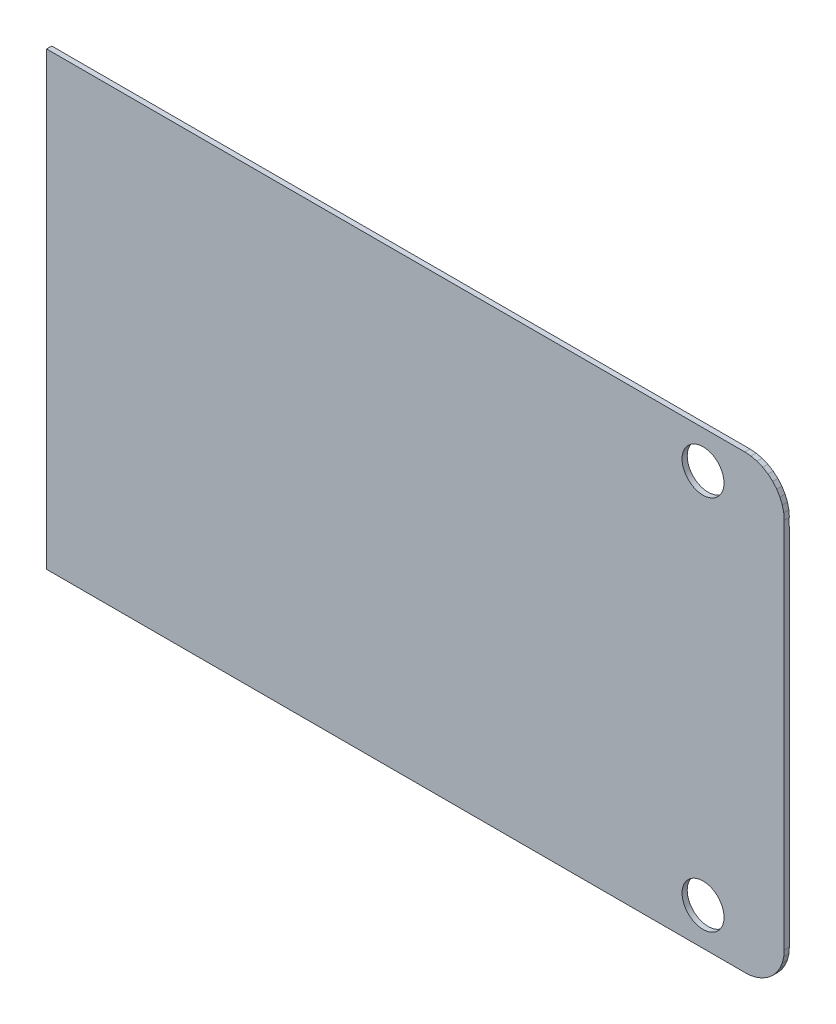
ISO-10303-21;
HEADER;
FILE_DESCRIPTION(('STEP AP214'),'2;1');
FILE_NAME('part.step','',(''),(''),'','','');
FILE_SCHEMA(('AUTOMOTIVE_DESIGN { 1 0 10303 214 1 1 1 1 }'));
ENDSEC;
DATA;
#1=APPLICATION_CONTEXT('core data for automotive mechanical design processes');
#2=APPLICATION_PROTOCOL_DEFINITION('international standard','automotive_design',2000,#1);
#3=PRODUCT_CONTEXT('',#1,'mechanical');
#4=PRODUCT('Part','Part','',(#3));
#5=PRODUCT_RELATED_PRODUCT_CATEGORY('part','',(#4));
#6=PRODUCT_DEFINITION_FORMATION('','',#4);
#7=PRODUCT_DEFINITION_CONTEXT('part definition',#1,'design');
#8=PRODUCT_DEFINITION('design','',#6,#7);
#9=PRODUCT_DEFINITION_SHAPE('','',#8);
#10=(LENGTH_UNIT() NAMED_UNIT(*) SI_UNIT(.MILLI.,.METRE.));
#11=(NAMED_UNIT(*) PLANE_ANGLE_UNIT() SI_UNIT($,.RADIAN.));
#12=(NAMED_UNIT(*) SI_UNIT($,.STERADIAN.) SOLID_ANGLE_UNIT());
#13=UNCERTAINTY_MEASURE_WITH_UNIT(LENGTH_MEASURE(1.E-05),#10,'distance_accuracy_value','');
#14=(GEOMETRIC_REPRESENTATION_CONTEXT(3) GLOBAL_UNCERTAINTY_ASSIGNED_CONTEXT((#13)) GLOBAL_UNIT_ASSIGNED_CONTEXT((#10,
#11,#12)) REPRESENTATION_CONTEXT('',''));
#15=CARTESIAN_POINT('',(0.,0.,0.));
#16=DIRECTION('',(0.,0.,1.));
#17=DIRECTION('',(1.,0.,0.));
#18=AXIS2_PLACEMENT_3D('',#15,#16,#17);
#19=CARTESIAN_POINT('',(42.69702916,-17.2042201,0.39116));
#20=DIRECTION('',(0.,0.,-1.));
#21=DIRECTION('',(-1.,0.,0.));
#22=AXIS2_PLACEMENT_3D('',#19,#20,#21);
#23=PLANE('',#22);
#24=CARTESIAN_POINT('',(39.50940028,14.351,0.39116));
#25=DIRECTION('',(0.,0.,-1.));
#26=DIRECTION('',(-1.,0.,0.));
#27=AXIS2_PLACEMENT_3D('',#24,#25,#26);
#28=CIRCLE('',#27,1.59999934);
#29=CARTESIAN_POINT('',(37.90940094,14.351,0.39116));
#30=VERTEX_POINT('',#29);
#31=EDGE_CURVE('E217',#30,#30,#28,.T.);
#32=ORIENTED_EDGE('',*,*,#31,.T.);
#33=EDGE_LOOP('',(#32));
#34=FACE_BOUND('',#33,.T.);
#35=CARTESIAN_POINT('',(39.50940028,-14.351,0.39116));
#36=DIRECTION('',(0.,0.,-1.));
#37=DIRECTION('',(-1.,0.,0.));
#38=AXIS2_PLACEMENT_3D('',#35,#36,#37);
#39=CIRCLE('',#38,1.59999934);
#40=CARTESIAN_POINT('',(37.90940094,-14.351,0.39116));
#41=VERTEX_POINT('',#40);
#42=EDGE_CURVE('E20',#41,#41,#39,.T.);
#43=ORIENTED_EDGE('',*,*,#42,.T.);
#44=EDGE_LOOP('',(#43));
#45=FACE_BOUND('',#44,.T.);
#46=DIRECTION('',(-0.996917476036965,-0.0784572875651972,0.));
#47=VECTOR('',#46,1.);
#48=CARTESIAN_POINT('',(42.69702916,-17.21349618,0.39116));
#49=LINE('',#48,#47);
#50=CARTESIAN_POINT('',(42.69702916,-17.21349618,0.39116));
#51=VERTEX_POINT('',#50);
#52=CARTESIAN_POINT('',(43.16778514,-17.17644774,0.39116));
#53=VERTEX_POINT('',#52);
#54=EDGE_CURVE('E234',#51,#53,#49,.F.);
#55=ORIENTED_EDGE('',*,*,#54,.T.);
#56=DIRECTION('',(-0.972369331182777,-0.233447818098947,0.));
#57=VECTOR('',#56,1.);
#58=CARTESIAN_POINT('',(43.16778514,-17.17644774,0.39116));
#59=LINE('',#58,#57);
#60=CARTESIAN_POINT('',(43.62694602,-17.06621174,0.39116));
#61=VERTEX_POINT('',#60);
#62=EDGE_CURVE('E238',#53,#61,#59,.F.);
#63=ORIENTED_EDGE('',*,*,#62,.T.);
#64=DIRECTION('',(-0.923879356143185,-0.382683858155076,0.));
#65=VECTOR('',#64,1.);
#66=CARTESIAN_POINT('',(43.62694602,-17.06621174,0.39116));
#67=LINE('',#66,#65);
#68=CARTESIAN_POINT('',(44.06321388,-16.88550344,0.39116));
#69=VERTEX_POINT('',#68);
#70=EDGE_CURVE('E242',#61,#69,#67,.F.);
#71=ORIENTED_EDGE('',*,*,#70,.T.);
#72=DIRECTION('',(-0.852641372425127,-0.522496593318078,0.));
#73=VECTOR('',#72,1.);
#74=CARTESIAN_POINT('',(44.06321388,-16.88550344,0.39116));
#75=LINE('',#74,#73);
#76=CARTESIAN_POINT('',(44.46583944,-16.63877546,0.39116));
#77=VERTEX_POINT('',#76);
#78=EDGE_CURVE('E246',#69,#77,#75,.F.);
#79=ORIENTED_EDGE('',*,*,#78,.T.);
#80=DIRECTION('',(-0.760403230011372,-0.649451251279318,0.));
#81=VECTOR('',#80,1.);
#82=CARTESIAN_POINT('',(44.46583944,-16.63877546,0.39116));
#83=LINE('',#82,#81);
#84=CARTESIAN_POINT('',(44.82490908,-16.3320984,0.39116));
#85=VERTEX_POINT('',#84);
#86=EDGE_CURVE('E250',#77,#85,#83,.F.);
#87=ORIENTED_EDGE('',*,*,#86,.T.);
#88=DIRECTION('',(-0.649451251279318,-0.760403230011372,0.));
#89=VECTOR('',#88,1.);
#90=CARTESIAN_POINT('',(44.82490908,-16.3320984,0.39116));
#91=LINE('',#90,#89);
#92=CARTESIAN_POINT('',(45.13158614,-15.97302876,0.39116));
#93=VERTEX_POINT('',#92);
#94=EDGE_CURVE('E254',#85,#93,#91,.F.);
#95=ORIENTED_EDGE('',*,*,#94,.T.);
#96=DIRECTION('',(-0.522496593318078,-0.852641372425127,0.));
#97=VECTOR('',#96,1.);
#98=CARTESIAN_POINT('',(45.13158614,-15.97302876,0.39116));
#99=LINE('',#98,#97);
#100=CARTESIAN_POINT('',(45.37831412,-15.5704032,0.39116));
#101=VERTEX_POINT('',#100);
#102=EDGE_CURVE('E258',#93,#101,#99,.F.);
#103=ORIENTED_EDGE('',*,*,#102,.T.);
#104=DIRECTION('',(-0.382683858155076,-0.923879356143185,0.));
#105=VECTOR('',#104,1.);
#106=CARTESIAN_POINT('',(45.37831412,-15.5704032,0.39116));
#107=LINE('',#106,#105);
#108=CARTESIAN_POINT('',(45.55902242,-15.13413534,0.39116));
#109=VERTEX_POINT('',#108);
#110=EDGE_CURVE('E262',#101,#109,#107,.F.);
#111=ORIENTED_EDGE('',*,*,#110,.T.);
#112=DIRECTION('',(-0.233447818098947,-0.972369331182777,0.));
#113=VECTOR('',#112,1.);
#114=CARTESIAN_POINT('',(45.55902242,-15.13413534,0.39116));
#115=LINE('',#114,#113);
#116=CARTESIAN_POINT('',(45.66925842,-14.67497446,0.39116));
#117=VERTEX_POINT('',#116);
#118=EDGE_CURVE('E266',#109,#117,#115,.F.);
#119=ORIENTED_EDGE('',*,*,#118,.T.);
#120=DIRECTION('',(-0.0784572875651674,-0.996917476036967,0.));
#121=VECTOR('',#120,1.);
#122=CARTESIAN_POINT('',(45.66925842,-14.67497446,0.39116));
#123=LINE('',#122,#121);
#124=CARTESIAN_POINT('',(45.70630686,-14.2042184800002,0.39116));
#125=VERTEX_POINT('',#124);
#126=EDGE_CURVE('E270',#117,#125,#123,.F.);
#127=ORIENTED_EDGE('',*,*,#126,.T.);
#128=DIRECTION('',(0.000326622323884776,-0.999999946658927,0.));
#129=VECTOR('',#128,1.);
#130=CARTESIAN_POINT('',(45.70630686,-14.20421848,0.39116));
#131=LINE('',#130,#129);
#132=CARTESIAN_POINT('',(45.69703078,14.19579838,0.39116));
#133=VERTEX_POINT('',#132);
#134=EDGE_CURVE('E274',#125,#133,#131,.F.);
#135=ORIENTED_EDGE('',*,*,#134,.T.);
#136=DIRECTION('',(1.,0.,0.));
#137=VECTOR('',#136,1.);
#138=CARTESIAN_POINT('',(45.69703078,14.19579838,0.39116));
#139=LINE('',#138,#137);
#140=CARTESIAN_POINT('',(45.70630686,14.19579838,0.39116));
#141=VERTEX_POINT('',#140);
#142=EDGE_CURVE('E278',#133,#141,#139,.T.);
#143=ORIENTED_EDGE('',*,*,#142,.T.);
#144=DIRECTION('',(0.0784572875651674,-0.996917476036967,0.));
#145=VECTOR('',#144,1.);
#146=CARTESIAN_POINT('',(45.70630686,14.19579838,0.39116));
#147=LINE('',#146,#145);
#148=CARTESIAN_POINT('',(45.66925842,14.66655436,0.39116));
#149=VERTEX_POINT('',#148);
#150=EDGE_CURVE('E282',#141,#149,#147,.F.);
#151=ORIENTED_EDGE('',*,*,#150,.T.);
#152=DIRECTION('',(0.233447818098947,-0.972369331182777,0.));
#153=VECTOR('',#152,1.);
#154=CARTESIAN_POINT('',(45.66925842,14.66655436,0.39116));
#155=LINE('',#154,#153);
#156=CARTESIAN_POINT('',(45.55902242,15.12571524,0.39116));
#157=VERTEX_POINT('',#156);
#158=EDGE_CURVE('E286',#149,#157,#155,.F.);
#159=ORIENTED_EDGE('',*,*,#158,.T.);
#160=DIRECTION('',(0.382683858155076,-0.923879356143185,0.));
#161=VECTOR('',#160,1.);
#162=CARTESIAN_POINT('',(45.55902242,15.12571524,0.39116));
#163=LINE('',#162,#161);
#164=CARTESIAN_POINT('',(45.37831412,15.5619831,0.39116));
#165=VERTEX_POINT('',#164);
#166=EDGE_CURVE('E290',#157,#165,#163,.F.);
#167=ORIENTED_EDGE('',*,*,#166,.T.);
#168=DIRECTION('',(0.522496593318078,-0.852641372425127,0.));
#169=VECTOR('',#168,1.);
#170=CARTESIAN_POINT('',(45.37831412,15.5619831,0.39116));
#171=LINE('',#170,#169);
#172=CARTESIAN_POINT('',(45.13158614,15.96460866,0.39116));
#173=VERTEX_POINT('',#172);
#174=EDGE_CURVE('E294',#165,#173,#171,.F.);
#175=ORIENTED_EDGE('',*,*,#174,.T.);
#176=DIRECTION('',(0.649451251279318,-0.760403230011372,0.));
#177=VECTOR('',#176,1.);
#178=CARTESIAN_POINT('',(45.13158614,15.96460866,0.39116));
#179=LINE('',#178,#177);
#180=CARTESIAN_POINT('',(44.82490908,16.3236783,0.39116));
#181=VERTEX_POINT('',#180);
#182=EDGE_CURVE('E298',#173,#181,#179,.F.);
#183=ORIENTED_EDGE('',*,*,#182,.T.);
#184=DIRECTION('',(0.760403230011372,-0.649451251279318,0.));
#185=VECTOR('',#184,1.);
#186=CARTESIAN_POINT('',(44.82490908,16.3236783,0.39116));
#187=LINE('',#186,#185);
#188=CARTESIAN_POINT('',(44.46583944,16.63035536,0.39116));
#189=VERTEX_POINT('',#188);
#190=EDGE_CURVE('E302',#181,#189,#187,.F.);
#191=ORIENTED_EDGE('',*,*,#190,.T.);
#192=DIRECTION('',(0.852641372425127,-0.522496593318078,0.));
#193=VECTOR('',#192,1.);
#194=CARTESIAN_POINT('',(44.46583944,16.63035536,0.39116));
#195=LINE('',#194,#193);
#196=CARTESIAN_POINT('',(44.06321388,16.87708334,0.39116));
#197=VERTEX_POINT('',#196);
#198=EDGE_CURVE('E306',#189,#197,#195,.F.);
#199=ORIENTED_EDGE('',*,*,#198,.T.);
#200=DIRECTION('',(0.923879356143185,-0.382683858155076,0.));
#201=VECTOR('',#200,1.);
#202=CARTESIAN_POINT('',(44.06321388,16.87708334,0.39116));
#203=LINE('',#202,#201);
#204=CARTESIAN_POINT('',(43.62694602,17.05779164,0.39116));
#205=VERTEX_POINT('',#204);
#206=EDGE_CURVE('E310',#197,#205,#203,.F.);
#207=ORIENTED_EDGE('',*,*,#206,.T.);
#208=DIRECTION('',(0.972369331182777,-0.233447818098947,0.));
#209=VECTOR('',#208,1.);
#210=CARTESIAN_POINT('',(43.62694602,17.05779164,0.39116));
#211=LINE('',#210,#209);
#212=CARTESIAN_POINT('',(43.16778514,17.16802764,0.39116));
#213=VERTEX_POINT('',#212);
#214=EDGE_CURVE('E314',#205,#213,#211,.F.);
#215=ORIENTED_EDGE('',*,*,#214,.T.);
#216=DIRECTION('',(0.996917476036965,-0.0784572875651972,0.));
#217=VECTOR('',#216,1.);
#218=CARTESIAN_POINT('',(43.16778514,17.16802764,0.39116));
#219=LINE('',#218,#217);
#220=CARTESIAN_POINT('',(42.6970291599995,17.20507608,0.39116));
#221=VERTEX_POINT('',#220);
#222=EDGE_CURVE('E318',#213,#221,#219,.F.);
#223=ORIENTED_EDGE('',*,*,#222,.T.);
#224=DIRECTION('',(0.999999984849512,0.000174071752104015,0.));
#225=VECTOR('',#224,1.);
#226=CARTESIAN_POINT('',(42.69702916,17.20507608,0.39116));
#227=LINE('',#226,#225);
#228=CARTESIAN_POINT('',(-10.5918,17.1958,0.39116));
#229=VERTEX_POINT('',#228);
#230=EDGE_CURVE('E188',#221,#229,#227,.F.);
#231=ORIENTED_EDGE('',*,*,#230,.T.);
#232=DIRECTION('',(0.,1.,0.));
#233=VECTOR('',#232,1.);
#234=CARTESIAN_POINT('',(-10.5918,17.1958,0.39116));
#235=LINE('',#234,#233);
#236=CARTESIAN_POINT('',(-10.5918,-17.2042201,0.39116));
#237=VERTEX_POINT('',#236);
#238=EDGE_CURVE('E190',#229,#237,#235,.F.);
#239=ORIENTED_EDGE('',*,*,#238,.T.);
#240=DIRECTION('',(1.,0.,0.));
#241=VECTOR('',#240,1.);
#242=CARTESIAN_POINT('',(-10.5918,-17.2042201,0.39116));
#243=LINE('',#242,#241);
#244=CARTESIAN_POINT('',(42.69702916,-17.2042201,0.39116));
#245=VERTEX_POINT('',#244);
#246=EDGE_CURVE('E192',#237,#245,#243,.T.);
#247=ORIENTED_EDGE('',*,*,#246,.T.);
#248=DIRECTION('',(0.,1.,0.));
#249=VECTOR('',#248,1.);
#250=CARTESIAN_POINT('',(42.69702916,-17.2042201,0.39116));
#251=LINE('',#250,#249);
#252=EDGE_CURVE('E226',#245,#51,#251,.F.);
#253=ORIENTED_EDGE('',*,*,#252,.T.);
#254=EDGE_LOOP('',(#55,#63,#71,#79,#87,#95,#103,#111,#119,#127,#135,#143,#151,#159,#167,#175,
#183,#191,#199,#207,#215,#223,#231,#239,#247,#253));
#255=FACE_BOUND('',#254,.T.);
#256=ADVANCED_FACE('F17',(#34,#45,#255),#23,.F.);
#257=CARTESIAN_POINT('',(-10.5918,-17.2042201,0.));
#258=DIRECTION('',(0.,1.,0.));
#259=DIRECTION('',(0.,0.,1.));
#260=AXIS2_PLACEMENT_3D('',#257,#258,#259);
#261=PLANE('',#260);
#262=DIRECTION('',(0.,0.,-1.));
#263=VECTOR('',#262,1.);
#264=CARTESIAN_POINT('',(42.69702916,-17.2042201,0.));
#265=LINE('',#264,#263);
#266=CARTESIAN_POINT('',(42.69702916,-17.2042201,0.));
#267=VERTEX_POINT('',#266);
#268=EDGE_CURVE('E203',#267,#245,#265,.F.);
#269=ORIENTED_EDGE('',*,*,#268,.T.);
#270=ORIENTED_EDGE('',*,*,#246,.F.);
#271=DIRECTION('',(0.,0.,-1.));
#272=VECTOR('',#271,1.);
#273=CARTESIAN_POINT('',(-10.5918,-17.2042201,0.));
#274=LINE('',#273,#272);
#275=CARTESIAN_POINT('',(-10.5918,-17.2042201,0.));
#276=VERTEX_POINT('',#275);
#277=EDGE_CURVE('E197',#237,#276,#274,.T.);
#278=ORIENTED_EDGE('',*,*,#277,.T.);
#279=DIRECTION('',(-1.,0.,0.));
#280=VECTOR('',#279,1.);
#281=CARTESIAN_POINT('',(42.69702916,-17.2042201,0.));
#282=LINE('',#281,#280);
#283=EDGE_CURVE('E219',#267,#276,#282,.T.);
#284=ORIENTED_EDGE('',*,*,#283,.F.);
#285=EDGE_LOOP('',(#269,#270,#278,#284));
#286=FACE_BOUND('',#285,.T.);
#287=ADVANCED_FACE('F200',(#286),#261,.F.);
#288=CARTESIAN_POINT('',(-10.5918,17.1958,0.));
#289=DIRECTION('',(1.,0.,0.));
#290=DIRECTION('',(0.,0.,-1.));
#291=AXIS2_PLACEMENT_3D('',#288,#289,#290);
#292=PLANE('',#291);
#293=ORIENTED_EDGE('',*,*,#277,.F.);
#294=ORIENTED_EDGE('',*,*,#238,.F.);
#295=DIRECTION('',(0.,0.,1.));
#296=VECTOR('',#295,1.);
#297=CARTESIAN_POINT('',(-10.5918,17.1958,0.));
#298=LINE('',#297,#296);
#299=CARTESIAN_POINT('',(-10.5918,17.1958,0.));
#300=VERTEX_POINT('',#299);
#301=EDGE_CURVE('E211',#229,#300,#298,.F.);
#302=ORIENTED_EDGE('',*,*,#301,.T.);
#303=DIRECTION('',(0.,1.,0.));
#304=VECTOR('',#303,1.);
#305=CARTESIAN_POINT('',(-10.5918,-17.2042201,0.));
#306=LINE('',#305,#304);
#307=EDGE_CURVE('E208',#276,#300,#306,.T.);
#308=ORIENTED_EDGE('',*,*,#307,.F.);
#309=EDGE_LOOP('',(#293,#294,#302,#308));
#310=FACE_BOUND('',#309,.T.);
#311=ADVANCED_FACE('F206',(#310),#292,.F.);
#312=CARTESIAN_POINT('',(42.69702916,17.20507608,0.));
#313=DIRECTION('',(0.000174071752104015,-0.999999984849512,0.));
#314=DIRECTION('',(0.999999984849512,0.000174071752104015,0.));
#315=AXIS2_PLACEMENT_3D('',#312,#313,#314);
#316=PLANE('',#315);
#317=ORIENTED_EDGE('',*,*,#301,.F.);
#318=ORIENTED_EDGE('',*,*,#230,.F.);
#319=DIRECTION('',(0.,0.,1.));
#320=VECTOR('',#319,1.);
#321=CARTESIAN_POINT('',(42.69702916,17.20507608,0.));
#322=LINE('',#321,#320);
#323=CARTESIAN_POINT('',(42.6970291599997,17.20507608,0.));
#324=VERTEX_POINT('',#323);
#325=EDGE_CURVE('E316',#221,#324,#322,.F.);
#326=ORIENTED_EDGE('',*,*,#325,.T.);
#327=DIRECTION('',(0.999999984849512,0.000174071752104376,0.));
#328=VECTOR('',#327,1.);
#329=CARTESIAN_POINT('',(-10.5918,17.1958,0.));
#330=LINE('',#329,#328);
#331=EDGE_CURVE('E322',#300,#324,#330,.T.);
#332=ORIENTED_EDGE('',*,*,#331,.F.);
#333=EDGE_LOOP('',(#317,#318,#326,#332));
#334=FACE_BOUND('',#333,.T.);
#335=ADVANCED_FACE('F323',(#334),#316,.F.);
#336=CARTESIAN_POINT('',(43.16778514,17.16802764,0.));
#337=DIRECTION('',(-0.0784572875651972,-0.996917476036965,0.));
#338=DIRECTION('',(0.996917476036965,-0.0784572875651972,0.));
#339=AXIS2_PLACEMENT_3D('',#336,#337,#338);
#340=PLANE('',#339);
#341=ORIENTED_EDGE('',*,*,#325,.F.);
#342=ORIENTED_EDGE('',*,*,#222,.F.);
#343=DIRECTION('',(0.,0.,1.));
#344=VECTOR('',#343,1.);
#345=CARTESIAN_POINT('',(43.16778514,17.1680276400001,0.));
#346=LINE('',#345,#344);
#347=CARTESIAN_POINT('',(43.16778514,17.16802764,0.));
#348=VERTEX_POINT('',#347);
#349=EDGE_CURVE('E312',#213,#348,#346,.F.);
#350=ORIENTED_EDGE('',*,*,#349,.T.);
#351=DIRECTION('',(0.996917476036962,-0.0784572875652345,0.));
#352=VECTOR('',#351,1.);
#353=CARTESIAN_POINT('',(42.69702916,17.20507608,0.));
#354=LINE('',#353,#352);
#355=EDGE_CURVE('E328',#324,#348,#354,.T.);
#356=ORIENTED_EDGE('',*,*,#355,.F.);
#357=EDGE_LOOP('',(#341,#342,#350,#356));
#358=FACE_BOUND('',#357,.T.);
#359=ADVANCED_FACE('F503',(#358),#340,.F.);
#360=CARTESIAN_POINT('',(43.62694602,17.05779164,0.));
#361=DIRECTION('',(-0.233447818098947,-0.972369331182777,0.));
#362=DIRECTION('',(0.972369331182777,-0.233447818098947,0.));
#363=AXIS2_PLACEMENT_3D('',#360,#361,#362);
#364=PLANE('',#363);
#365=ORIENTED_EDGE('',*,*,#349,.F.);
#366=ORIENTED_EDGE('',*,*,#214,.F.);
#367=DIRECTION('',(0.,0.,1.));
#368=VECTOR('',#367,1.);
#369=CARTESIAN_POINT('',(43.62694602,17.0577916400001,0.));
#370=LINE('',#369,#368);
#371=CARTESIAN_POINT('',(43.62694602,17.05779164,0.));
#372=VERTEX_POINT('',#371);
#373=EDGE_CURVE('E308',#205,#372,#370,.F.);
#374=ORIENTED_EDGE('',*,*,#373,.T.);
#375=DIRECTION('',(0.972369331182841,-0.233447818098681,0.));
#376=VECTOR('',#375,1.);
#377=CARTESIAN_POINT('',(43.16778514,17.16802764,0.));
#378=LINE('',#377,#376);
#379=EDGE_CURVE('E335',#348,#372,#378,.T.);
#380=ORIENTED_EDGE('',*,*,#379,.F.);
#381=EDGE_LOOP('',(#365,#366,#374,#380));
#382=FACE_BOUND('',#381,.T.);
#383=ADVANCED_FACE('F500',(#382),#364,.F.);
#384=CARTESIAN_POINT('',(44.06321388,16.87708334,0.));
#385=DIRECTION('',(-0.382683858155076,-0.923879356143185,0.));
#386=DIRECTION('',(0.923879356143185,-0.382683858155076,0.));
#387=AXIS2_PLACEMENT_3D('',#384,#385,#386);
#388=PLANE('',#387);
#389=ORIENTED_EDGE('',*,*,#373,.F.);
#390=ORIENTED_EDGE('',*,*,#206,.F.);
#391=DIRECTION('',(0.,0.,1.));
#392=VECTOR('',#391,1.);
#393=CARTESIAN_POINT('',(44.0632138799999,16.8770833399999,0.));
#394=LINE('',#393,#392);
#395=CARTESIAN_POINT('',(44.06321388,16.87708334,0.));
#396=VERTEX_POINT('',#395);
#397=EDGE_CURVE('E304',#197,#396,#394,.F.);
#398=ORIENTED_EDGE('',*,*,#397,.T.);
#399=DIRECTION('',(0.92387935614329,-0.382683858154822,0.));
#400=VECTOR('',#399,1.);
#401=CARTESIAN_POINT('',(43.62694602,17.05779164,0.));
#402=LINE('',#401,#400);
#403=EDGE_CURVE('E338',#372,#396,#402,.T.);
#404=ORIENTED_EDGE('',*,*,#403,.F.);
#405=EDGE_LOOP('',(#389,#390,#398,#404));
#406=FACE_BOUND('',#405,.T.);
#407=ADVANCED_FACE('F495',(#406),#388,.F.);
#408=CARTESIAN_POINT('',(44.46583944,16.63035536,0.));
#409=DIRECTION('',(-0.522496593318078,-0.852641372425127,0.));
#410=DIRECTION('',(0.852641372425127,-0.522496593318078,0.));
#411=AXIS2_PLACEMENT_3D('',#408,#409,#410);
#412=PLANE('',#411);
#413=ORIENTED_EDGE('',*,*,#397,.F.);
#414=ORIENTED_EDGE('',*,*,#198,.F.);
#415=DIRECTION('',(0.,0.,1.));
#416=VECTOR('',#415,1.);
#417=CARTESIAN_POINT('',(44.46583944,16.63035536,0.));
#418=LINE('',#417,#416);
#419=CARTESIAN_POINT('',(44.46583944,16.63035536,0.));
#420=VERTEX_POINT('',#419);
#421=EDGE_CURVE('E300',#189,#420,#418,.F.);
#422=ORIENTED_EDGE('',*,*,#421,.T.);
#423=DIRECTION('',(0.852641372425021,-0.522496593318249,0.));
#424=VECTOR('',#423,1.);
#425=CARTESIAN_POINT('',(44.06321388,16.87708334,0.));
#426=LINE('',#425,#424);
#427=EDGE_CURVE('E341',#396,#420,#426,.T.);
#428=ORIENTED_EDGE('',*,*,#427,.F.);
#429=EDGE_LOOP('',(#413,#414,#422,#428));
#430=FACE_BOUND('',#429,.T.);
#431=ADVANCED_FACE('F490',(#430),#412,.F.);
#432=CARTESIAN_POINT('',(44.82490908,16.3236783,0.));
#433=DIRECTION('',(-0.649451251279318,-0.760403230011372,0.));
#434=DIRECTION('',(0.760403230011372,-0.649451251279318,0.));
#435=AXIS2_PLACEMENT_3D('',#432,#433,#434);
#436=PLANE('',#435);
#437=ORIENTED_EDGE('',*,*,#421,.F.);
#438=ORIENTED_EDGE('',*,*,#190,.F.);
#439=DIRECTION('',(0.,0.,1.));
#440=VECTOR('',#439,1.);
#441=CARTESIAN_POINT('',(44.82490908,16.3236783,0.));
#442=LINE('',#441,#440);
#443=CARTESIAN_POINT('',(44.82490908,16.3236783,0.));
#444=VERTEX_POINT('',#443);
#445=EDGE_CURVE('E296',#181,#444,#442,.F.);
#446=ORIENTED_EDGE('',*,*,#445,.T.);
#447=DIRECTION('',(0.760403230011402,-0.649451251279283,0.));
#448=VECTOR('',#447,1.);
#449=CARTESIAN_POINT('',(44.46583944,16.63035536,0.));
#450=LINE('',#449,#448);
#451=EDGE_CURVE('E344',#420,#444,#450,.T.);
#452=ORIENTED_EDGE('',*,*,#451,.F.);
#453=EDGE_LOOP('',(#437,#438,#446,#452));
#454=FACE_BOUND('',#453,.T.);
#455=ADVANCED_FACE('F485',(#454),#436,.F.);
#456=CARTESIAN_POINT('',(45.13158614,15.96460866,0.));
#457=DIRECTION('',(-0.760403230011372,-0.649451251279318,0.));
#458=DIRECTION('',(0.649451251279318,-0.760403230011372,0.));
#459=AXIS2_PLACEMENT_3D('',#456,#457,#458);
#460=PLANE('',#459);
#461=ORIENTED_EDGE('',*,*,#445,.F.);
#462=ORIENTED_EDGE('',*,*,#182,.F.);
#463=DIRECTION('',(0.,0.,1.));
#464=VECTOR('',#463,1.);
#465=CARTESIAN_POINT('',(45.1315861400001,15.96460866,0.));
#466=LINE('',#465,#464);
#467=CARTESIAN_POINT('',(45.13158614,15.96460866,0.));
#468=VERTEX_POINT('',#467);
#469=EDGE_CURVE('E292',#173,#468,#466,.F.);
#470=ORIENTED_EDGE('',*,*,#469,.T.);
#471=DIRECTION('',(0.649451251279293,-0.760403230011394,0.));
#472=VECTOR('',#471,1.);
#473=CARTESIAN_POINT('',(44.82490908,16.3236783,0.));
#474=LINE('',#473,#472);
#475=EDGE_CURVE('E347',#444,#468,#474,.T.);
#476=ORIENTED_EDGE('',*,*,#475,.F.);
#477=EDGE_LOOP('',(#461,#462,#470,#476));
#478=FACE_BOUND('',#477,.T.);
#479=ADVANCED_FACE('F480',(#478),#460,.F.);
#480=CARTESIAN_POINT('',(45.37831412,15.5619831,0.));
#481=DIRECTION('',(-0.852641372425127,-0.522496593318078,0.));
#482=DIRECTION('',(0.522496593318078,-0.852641372425127,0.));
#483=AXIS2_PLACEMENT_3D('',#480,#481,#482);
#484=PLANE('',#483);
#485=ORIENTED_EDGE('',*,*,#469,.F.);
#486=ORIENTED_EDGE('',*,*,#174,.F.);
#487=DIRECTION('',(0.,0.,1.));
#488=VECTOR('',#487,1.);
#489=CARTESIAN_POINT('',(45.3783141199999,15.5619830999999,0.));
#490=LINE('',#489,#488);
#491=CARTESIAN_POINT('',(45.37831412,15.5619831,0.));
#492=VERTEX_POINT('',#491);
#493=EDGE_CURVE('E288',#165,#492,#490,.F.);
#494=ORIENTED_EDGE('',*,*,#493,.T.);
#495=DIRECTION('',(0.522496593318239,-0.852641372425028,0.));
#496=VECTOR('',#495,1.);
#497=CARTESIAN_POINT('',(45.13158614,15.96460866,0.));
#498=LINE('',#497,#496);
#499=EDGE_CURVE('E350',#468,#492,#498,.T.);
#500=ORIENTED_EDGE('',*,*,#499,.F.);
#501=EDGE_LOOP('',(#485,#486,#494,#500));
#502=FACE_BOUND('',#501,.T.);
#503=ADVANCED_FACE('F475',(#502),#484,.F.);
#504=CARTESIAN_POINT('',(45.55902242,15.12571524,0.));
#505=DIRECTION('',(-0.923879356143185,-0.382683858155076,0.));
#506=DIRECTION('',(0.382683858155076,-0.923879356143185,0.));
#507=AXIS2_PLACEMENT_3D('',#504,#505,#506);
#508=PLANE('',#507);
#509=ORIENTED_EDGE('',*,*,#493,.F.);
#510=ORIENTED_EDGE('',*,*,#166,.F.);
#511=DIRECTION('',(0.,0.,1.));
#512=VECTOR('',#511,1.);
#513=CARTESIAN_POINT('',(45.5590224199999,15.12571524,0.));
#514=LINE('',#513,#512);
#515=CARTESIAN_POINT('',(45.55902242,15.12571524,0.));
#516=VERTEX_POINT('',#515);
#517=EDGE_CURVE('E284',#157,#516,#514,.F.);
#518=ORIENTED_EDGE('',*,*,#517,.T.);
#519=DIRECTION('',(0.382683858154822,-0.92387935614329,0.));
#520=VECTOR('',#519,1.);
#521=CARTESIAN_POINT('',(45.37831412,15.5619831,0.));
#522=LINE('',#521,#520);
#523=EDGE_CURVE('E353',#492,#516,#522,.T.);
#524=ORIENTED_EDGE('',*,*,#523,.F.);
#525=EDGE_LOOP('',(#509,#510,#518,#524));
#526=FACE_BOUND('',#525,.T.);
#527=ADVANCED_FACE('F470',(#526),#508,.F.);
#528=CARTESIAN_POINT('',(45.66925842,14.66655436,0.));
#529=DIRECTION('',(-0.972369331182777,-0.233447818098947,0.));
#530=DIRECTION('',(0.233447818098947,-0.972369331182777,0.));
#531=AXIS2_PLACEMENT_3D('',#528,#529,#530);
#532=PLANE('',#531);
#533=ORIENTED_EDGE('',*,*,#517,.F.);
#534=ORIENTED_EDGE('',*,*,#158,.F.);
#535=DIRECTION('',(0.,0.,1.));
#536=VECTOR('',#535,1.);
#537=CARTESIAN_POINT('',(45.66925842,14.66655436,0.));
#538=LINE('',#537,#536);
#539=CARTESIAN_POINT('',(45.66925842,14.66655436,0.));
#540=VERTEX_POINT('',#539);
#541=EDGE_CURVE('E280',#149,#540,#538,.F.);
#542=ORIENTED_EDGE('',*,*,#541,.T.);
#543=DIRECTION('',(0.233447818098681,-0.972369331182841,0.));
#544=VECTOR('',#543,1.);
#545=CARTESIAN_POINT('',(45.55902242,15.12571524,0.));
#546=LINE('',#545,#544);
#547=EDGE_CURVE('E356',#516,#540,#546,.T.);
#548=ORIENTED_EDGE('',*,*,#547,.F.);
#549=EDGE_LOOP('',(#533,#534,#542,#548));
#550=FACE_BOUND('',#549,.T.);
#551=ADVANCED_FACE('F465',(#550),#532,.F.);
#552=CARTESIAN_POINT('',(45.70630686,14.19579838,0.));
#553=DIRECTION('',(-0.996917476036967,-0.0784572875651674,0.));
#554=DIRECTION('',(0.0784572875651674,-0.996917476036967,0.));
#555=AXIS2_PLACEMENT_3D('',#552,#553,#554);
#556=PLANE('',#555);
#557=ORIENTED_EDGE('',*,*,#541,.F.);
#558=ORIENTED_EDGE('',*,*,#150,.F.);
#559=DIRECTION('',(0.,0.,1.));
#560=VECTOR('',#559,1.);
#561=CARTESIAN_POINT('',(45.70630686,14.19579838,0.));
#562=LINE('',#561,#560);
#563=CARTESIAN_POINT('',(45.70630686,14.19579838,0.));
#564=VERTEX_POINT('',#563);
#565=EDGE_CURVE('E276',#141,#564,#562,.F.);
#566=ORIENTED_EDGE('',*,*,#565,.T.);
#567=DIRECTION('',(0.0784572875652187,-0.996917476036963,0.));
#568=VECTOR('',#567,1.);
#569=CARTESIAN_POINT('',(45.66925842,14.66655436,0.));
#570=LINE('',#569,#568);
#571=EDGE_CURVE('E359',#540,#564,#570,.T.);
#572=ORIENTED_EDGE('',*,*,#571,.F.);
#573=EDGE_LOOP('',(#557,#558,#566,#572));
#574=FACE_BOUND('',#573,.T.);
#575=ADVANCED_FACE('F460',(#574),#556,.F.);
#576=CARTESIAN_POINT('',(45.69703078,14.19579838,0.));
#577=DIRECTION('',(0.,1.,0.));
#578=DIRECTION('',(0.,0.,1.));
#579=AXIS2_PLACEMENT_3D('',#576,#577,#578);
#580=PLANE('',#579);
#581=ORIENTED_EDGE('',*,*,#565,.F.);
#582=ORIENTED_EDGE('',*,*,#142,.F.);
#583=DIRECTION('',(0.,0.,1.));
#584=VECTOR('',#583,1.);
#585=CARTESIAN_POINT('',(45.69703078,14.19579838,0.));
#586=LINE('',#585,#584);
#587=CARTESIAN_POINT('',(45.69703078,14.19579838,0.));
#588=VERTEX_POINT('',#587);
#589=EDGE_CURVE('E272',#133,#588,#586,.F.);
#590=ORIENTED_EDGE('',*,*,#589,.T.);
#591=DIRECTION('',(-1.,0.,0.));
#592=VECTOR('',#591,1.);
#593=CARTESIAN_POINT('',(42.69702916,14.19579838,0.));
#594=LINE('',#593,#592);
#595=EDGE_CURVE('E362',#564,#588,#594,.T.);
#596=ORIENTED_EDGE('',*,*,#595,.F.);
#597=EDGE_LOOP('',(#581,#582,#590,#596));
#598=FACE_BOUND('',#597,.T.);
#599=ADVANCED_FACE('F455',(#598),#580,.F.);
#600=CARTESIAN_POINT('',(45.70630686,-14.20421848,0.));
#601=DIRECTION('',(-0.999999946658927,-0.000326622323884776,0.));
#602=DIRECTION('',(0.000326622323884776,-0.999999946658927,0.));
#603=AXIS2_PLACEMENT_3D('',#600,#601,#602);
#604=PLANE('',#603);
#605=ORIENTED_EDGE('',*,*,#589,.F.);
#606=ORIENTED_EDGE('',*,*,#134,.F.);
#607=DIRECTION('',(0.,0.,1.));
#608=VECTOR('',#607,1.);
#609=CARTESIAN_POINT('',(45.70630686,-14.20421848,0.));
#610=LINE('',#609,#608);
#611=CARTESIAN_POINT('',(45.70630686,-14.2042184800001,0.));
#612=VERTEX_POINT('',#611);
#613=EDGE_CURVE('E268',#125,#612,#610,.F.);
#614=ORIENTED_EDGE('',*,*,#613,.T.);
#615=DIRECTION('',(0.000326622323885451,-0.999999946658927,0.));
#616=VECTOR('',#615,1.);
#617=CARTESIAN_POINT('',(45.69703078,14.19579838,0.));
#618=LINE('',#617,#616);
#619=EDGE_CURVE('E365',#588,#612,#618,.T.);
#620=ORIENTED_EDGE('',*,*,#619,.F.);
#621=EDGE_LOOP('',(#605,#606,#614,#620));
#622=FACE_BOUND('',#621,.T.);
#623=ADVANCED_FACE('F450',(#622),#604,.F.);
#624=CARTESIAN_POINT('',(45.66925842,-14.67497446,0.));
#625=DIRECTION('',(-0.996917476036967,0.0784572875651674,0.));
#626=DIRECTION('',(-0.0784572875651674,-0.996917476036967,0.));
#627=AXIS2_PLACEMENT_3D('',#624,#625,#626);
#628=PLANE('',#627);
#629=ORIENTED_EDGE('',*,*,#613,.F.);
#630=ORIENTED_EDGE('',*,*,#126,.F.);
#631=DIRECTION('',(0.,0.,1.));
#632=VECTOR('',#631,1.);
#633=CARTESIAN_POINT('',(45.6692584200001,-14.67497446,0.));
#634=LINE('',#633,#632);
#635=CARTESIAN_POINT('',(45.66925842,-14.67497446,0.));
#636=VERTEX_POINT('',#635);
#637=EDGE_CURVE('E264',#117,#636,#634,.F.);
#638=ORIENTED_EDGE('',*,*,#637,.T.);
#639=DIRECTION('',(-0.078457287565219,-0.996917476036963,0.));
#640=VECTOR('',#639,1.);
#641=CARTESIAN_POINT('',(45.70630686,-14.20421848,0.));
#642=LINE('',#641,#640);
#643=EDGE_CURVE('E368',#612,#636,#642,.T.);
#644=ORIENTED_EDGE('',*,*,#643,.F.);
#645=EDGE_LOOP('',(#629,#630,#638,#644));
#646=FACE_BOUND('',#645,.T.);
#647=ADVANCED_FACE('F445',(#646),#628,.F.);
#648=CARTESIAN_POINT('',(45.55902242,-15.13413534,0.));
#649=DIRECTION('',(-0.972369331182777,0.233447818098947,0.));
#650=DIRECTION('',(-0.233447818098947,-0.972369331182777,0.));
#651=AXIS2_PLACEMENT_3D('',#648,#649,#650);
#652=PLANE('',#651);
#653=ORIENTED_EDGE('',*,*,#637,.F.);
#654=ORIENTED_EDGE('',*,*,#118,.F.);
#655=DIRECTION('',(0.,0.,1.));
#656=VECTOR('',#655,1.);
#657=CARTESIAN_POINT('',(45.5590224200001,-15.1341353400001,0.));
#658=LINE('',#657,#656);
#659=CARTESIAN_POINT('',(45.55902242,-15.13413534,0.));
#660=VERTEX_POINT('',#659);
#661=EDGE_CURVE('E260',#109,#660,#658,.F.);
#662=ORIENTED_EDGE('',*,*,#661,.T.);
#663=DIRECTION('',(-0.233447818098683,-0.97236933118284,0.));
#664=VECTOR('',#663,1.);
#665=CARTESIAN_POINT('',(45.66925842,-14.67497446,0.));
#666=LINE('',#665,#664);
#667=EDGE_CURVE('E371',#636,#660,#666,.T.);
#668=ORIENTED_EDGE('',*,*,#667,.F.);
#669=EDGE_LOOP('',(#653,#654,#662,#668));
#670=FACE_BOUND('',#669,.T.);
#671=ADVANCED_FACE('F440',(#670),#652,.F.);
#672=CARTESIAN_POINT('',(45.37831412,-15.5704032,0.));
#673=DIRECTION('',(-0.923879356143185,0.382683858155076,0.));
#674=DIRECTION('',(-0.382683858155076,-0.923879356143185,0.));
#675=AXIS2_PLACEMENT_3D('',#672,#673,#674);
#676=PLANE('',#675);
#677=ORIENTED_EDGE('',*,*,#661,.F.);
#678=ORIENTED_EDGE('',*,*,#110,.F.);
#679=DIRECTION('',(0.,0.,1.));
#680=VECTOR('',#679,1.);
#681=CARTESIAN_POINT('',(45.3783141199999,-15.5704032,0.));
#682=LINE('',#681,#680);
#683=CARTESIAN_POINT('',(45.37831412,-15.5704032,0.));
#684=VERTEX_POINT('',#683);
#685=EDGE_CURVE('E256',#101,#684,#682,.F.);
#686=ORIENTED_EDGE('',*,*,#685,.T.);
#687=DIRECTION('',(-0.382683858154822,-0.92387935614329,0.));
#688=VECTOR('',#687,1.);
#689=CARTESIAN_POINT('',(45.55902242,-15.13413534,0.));
#690=LINE('',#689,#688);
#691=EDGE_CURVE('E374',#660,#684,#690,.T.);
#692=ORIENTED_EDGE('',*,*,#691,.F.);
#693=EDGE_LOOP('',(#677,#678,#686,#692));
#694=FACE_BOUND('',#693,.T.);
#695=ADVANCED_FACE('F435',(#694),#676,.F.);
#696=CARTESIAN_POINT('',(45.13158614,-15.97302876,0.));
#697=DIRECTION('',(-0.852641372425127,0.522496593318078,0.));
#698=DIRECTION('',(-0.522496593318078,-0.852641372425127,0.));
#699=AXIS2_PLACEMENT_3D('',#696,#697,#698);
#700=PLANE('',#699);
#701=ORIENTED_EDGE('',*,*,#685,.F.);
#702=ORIENTED_EDGE('',*,*,#102,.F.);
#703=DIRECTION('',(0.,0.,1.));
#704=VECTOR('',#703,1.);
#705=CARTESIAN_POINT('',(45.13158614,-15.97302876,0.));
#706=LINE('',#705,#704);
#707=CARTESIAN_POINT('',(45.13158614,-15.97302876,0.));
#708=VERTEX_POINT('',#707);
#709=EDGE_CURVE('E252',#93,#708,#706,.F.);
#710=ORIENTED_EDGE('',*,*,#709,.T.);
#711=DIRECTION('',(-0.522496593318239,-0.852641372425028,0.));
#712=VECTOR('',#711,1.);
#713=CARTESIAN_POINT('',(45.37831412,-15.5704032,0.));
#714=LINE('',#713,#712);
#715=EDGE_CURVE('E377',#684,#708,#714,.T.);
#716=ORIENTED_EDGE('',*,*,#715,.F.);
#717=EDGE_LOOP('',(#701,#702,#710,#716));
#718=FACE_BOUND('',#717,.T.);
#719=ADVANCED_FACE('F430',(#718),#700,.F.);
#720=CARTESIAN_POINT('',(44.82490908,-16.3320984,0.));
#721=DIRECTION('',(-0.760403230011372,0.649451251279318,0.));
#722=DIRECTION('',(-0.649451251279318,-0.760403230011372,0.));
#723=AXIS2_PLACEMENT_3D('',#720,#721,#722);
#724=PLANE('',#723);
#725=ORIENTED_EDGE('',*,*,#709,.F.);
#726=ORIENTED_EDGE('',*,*,#94,.F.);
#727=DIRECTION('',(0.,0.,1.));
#728=VECTOR('',#727,1.);
#729=CARTESIAN_POINT('',(44.82490908,-16.3320984,0.));
#730=LINE('',#729,#728);
#731=CARTESIAN_POINT('',(44.82490908,-16.3320984,0.));
#732=VERTEX_POINT('',#731);
#733=EDGE_CURVE('E248',#85,#732,#730,.F.);
#734=ORIENTED_EDGE('',*,*,#733,.T.);
#735=DIRECTION('',(-0.649451251279293,-0.760403230011394,0.));
#736=VECTOR('',#735,1.);
#737=CARTESIAN_POINT('',(45.13158614,-15.97302876,0.));
#738=LINE('',#737,#736);
#739=EDGE_CURVE('E380',#708,#732,#738,.T.);
#740=ORIENTED_EDGE('',*,*,#739,.F.);
#741=EDGE_LOOP('',(#725,#726,#734,#740));
#742=FACE_BOUND('',#741,.T.);
#743=ADVANCED_FACE('F425',(#742),#724,.F.);
#744=CARTESIAN_POINT('',(44.46583944,-16.63877546,0.));
#745=DIRECTION('',(-0.649451251279318,0.760403230011372,0.));
#746=DIRECTION('',(-0.760403230011372,-0.649451251279318,0.));
#747=AXIS2_PLACEMENT_3D('',#744,#745,#746);
#748=PLANE('',#747);
#749=ORIENTED_EDGE('',*,*,#733,.F.);
#750=ORIENTED_EDGE('',*,*,#86,.F.);
#751=DIRECTION('',(0.,0.,1.));
#752=VECTOR('',#751,1.);
#753=CARTESIAN_POINT('',(44.4658394400001,-16.6387754600001,0.));
#754=LINE('',#753,#752);
#755=CARTESIAN_POINT('',(44.46583944,-16.63877546,0.));
#756=VERTEX_POINT('',#755);
#757=EDGE_CURVE('E244',#77,#756,#754,.F.);
#758=ORIENTED_EDGE('',*,*,#757,.T.);
#759=DIRECTION('',(-0.760403230011399,-0.649451251279287,0.));
#760=VECTOR('',#759,1.);
#761=CARTESIAN_POINT('',(44.82490908,-16.3320984,0.));
#762=LINE('',#761,#760);
#763=EDGE_CURVE('E383',#732,#756,#762,.T.);
#764=ORIENTED_EDGE('',*,*,#763,.F.);
#765=EDGE_LOOP('',(#749,#750,#758,#764));
#766=FACE_BOUND('',#765,.T.);
#767=ADVANCED_FACE('F420',(#766),#748,.F.);
#768=CARTESIAN_POINT('',(44.06321388,-16.88550344,0.));
#769=DIRECTION('',(-0.522496593318078,0.852641372425127,0.));
#770=DIRECTION('',(-0.852641372425127,-0.522496593318078,0.));
#771=AXIS2_PLACEMENT_3D('',#768,#769,#770);
#772=PLANE('',#771);
#773=ORIENTED_EDGE('',*,*,#757,.F.);
#774=ORIENTED_EDGE('',*,*,#78,.F.);
#775=DIRECTION('',(0.,0.,1.));
#776=VECTOR('',#775,1.);
#777=CARTESIAN_POINT('',(44.0632138799999,-16.8855034399999,0.));
#778=LINE('',#777,#776);
#779=CARTESIAN_POINT('',(44.06321388,-16.88550344,0.));
#780=VERTEX_POINT('',#779);
#781=EDGE_CURVE('E240',#69,#780,#778,.F.);
#782=ORIENTED_EDGE('',*,*,#781,.T.);
#783=DIRECTION('',(-0.852641372425021,-0.522496593318249,0.));
#784=VECTOR('',#783,1.);
#785=CARTESIAN_POINT('',(44.46583944,-16.63877546,0.));
#786=LINE('',#785,#784);
#787=EDGE_CURVE('E386',#756,#780,#786,.T.);
#788=ORIENTED_EDGE('',*,*,#787,.F.);
#789=EDGE_LOOP('',(#773,#774,#782,#788));
#790=FACE_BOUND('',#789,.T.);
#791=ADVANCED_FACE('F415',(#790),#772,.F.);
#792=CARTESIAN_POINT('',(43.62694602,-17.06621174,0.));
#793=DIRECTION('',(-0.382683858155076,0.923879356143185,0.));
#794=DIRECTION('',(-0.923879356143185,-0.382683858155076,0.));
#795=AXIS2_PLACEMENT_3D('',#792,#793,#794);
#796=PLANE('',#795);
#797=ORIENTED_EDGE('',*,*,#781,.F.);
#798=ORIENTED_EDGE('',*,*,#70,.F.);
#799=DIRECTION('',(0.,0.,1.));
#800=VECTOR('',#799,1.);
#801=CARTESIAN_POINT('',(43.62694602,-17.0662117399999,0.));
#802=LINE('',#801,#800);
#803=CARTESIAN_POINT('',(43.62694602,-17.06621174,0.));
#804=VERTEX_POINT('',#803);
#805=EDGE_CURVE('E236',#61,#804,#802,.F.);
#806=ORIENTED_EDGE('',*,*,#805,.T.);
#807=DIRECTION('',(-0.92387935614329,-0.382683858154822,0.));
#808=VECTOR('',#807,1.);
#809=CARTESIAN_POINT('',(44.06321388,-16.88550344,0.));
#810=LINE('',#809,#808);
#811=EDGE_CURVE('E389',#780,#804,#810,.T.);
#812=ORIENTED_EDGE('',*,*,#811,.F.);
#813=EDGE_LOOP('',(#797,#798,#806,#812));
#814=FACE_BOUND('',#813,.T.);
#815=ADVANCED_FACE('F410',(#814),#796,.F.);
#816=CARTESIAN_POINT('',(43.16778514,-17.17644774,0.));
#817=DIRECTION('',(-0.233447818098947,0.972369331182777,0.));
#818=DIRECTION('',(-0.972369331182777,-0.233447818098947,0.));
#819=AXIS2_PLACEMENT_3D('',#816,#817,#818);
#820=PLANE('',#819);
#821=ORIENTED_EDGE('',*,*,#805,.F.);
#822=ORIENTED_EDGE('',*,*,#62,.F.);
#823=DIRECTION('',(0.,0.,1.));
#824=VECTOR('',#823,1.);
#825=CARTESIAN_POINT('',(43.16778514,-17.17644774,0.));
#826=LINE('',#825,#824);
#827=CARTESIAN_POINT('',(43.16778514,-17.17644774,0.));
#828=VERTEX_POINT('',#827);
#829=EDGE_CURVE('E232',#53,#828,#826,.F.);
#830=ORIENTED_EDGE('',*,*,#829,.T.);
#831=DIRECTION('',(-0.972369331182841,-0.233447818098681,0.));
#832=VECTOR('',#831,1.);
#833=CARTESIAN_POINT('',(43.62694602,-17.06621174,0.));
#834=LINE('',#833,#832);
#835=EDGE_CURVE('E392',#804,#828,#834,.T.);
#836=ORIENTED_EDGE('',*,*,#835,.F.);
#837=EDGE_LOOP('',(#821,#822,#830,#836));
#838=FACE_BOUND('',#837,.T.);
#839=ADVANCED_FACE('F405',(#838),#820,.F.);
#840=CARTESIAN_POINT('',(42.69702916,-17.21349618,0.));
#841=DIRECTION('',(-0.0784572875651972,0.996917476036965,0.));
#842=DIRECTION('',(-0.996917476036965,-0.0784572875651972,0.));
#843=AXIS2_PLACEMENT_3D('',#840,#841,#842);
#844=PLANE('',#843);
#845=ORIENTED_EDGE('',*,*,#829,.F.);
#846=ORIENTED_EDGE('',*,*,#54,.F.);
#847=DIRECTION('',(0.,0.,-1.));
#848=VECTOR('',#847,1.);
#849=CARTESIAN_POINT('',(42.69702916,-17.21349618,0.));
#850=LINE('',#849,#848);
#851=CARTESIAN_POINT('',(42.69702916,-17.21349618,0.));
#852=VERTEX_POINT('',#851);
#853=EDGE_CURVE('E35',#51,#852,#850,.T.);
#854=ORIENTED_EDGE('',*,*,#853,.T.);
#855=DIRECTION('',(-0.996917476036963,-0.0784572875652199,0.));
#856=VECTOR('',#855,1.);
#857=CARTESIAN_POINT('',(43.16778514,-17.17644774,0.));
#858=LINE('',#857,#856);
#859=EDGE_CURVE('E395',#828,#852,#858,.T.);
#860=ORIENTED_EDGE('',*,*,#859,.F.);
#861=EDGE_LOOP('',(#845,#846,#854,#860));
#862=FACE_BOUND('',#861,.T.);
#863=ADVANCED_FACE('F401',(#862),#844,.F.);
#864=CARTESIAN_POINT('',(42.69702916,-17.2042201,0.));
#865=DIRECTION('',(1.,0.,0.));
#866=DIRECTION('',(0.,0.,-1.));
#867=AXIS2_PLACEMENT_3D('',#864,#865,#866);
#868=PLANE('',#867);
#869=ORIENTED_EDGE('',*,*,#853,.F.);
#870=ORIENTED_EDGE('',*,*,#252,.F.);
#871=ORIENTED_EDGE('',*,*,#268,.F.);
#872=DIRECTION('',(0.,1.,0.));
#873=VECTOR('',#872,1.);
#874=CARTESIAN_POINT('',(42.69702916,-17.2042201,0.));
#875=LINE('',#874,#873);
#876=EDGE_CURVE('E216',#852,#267,#875,.T.);
#877=ORIENTED_EDGE('',*,*,#876,.F.);
#878=EDGE_LOOP('',(#869,#870,#871,#877));
#879=FACE_BOUND('',#878,.T.);
#880=ADVANCED_FACE('F398',(#879),#868,.F.);
#881=CARTESIAN_POINT('',(39.50940028,-14.351,0.));
#882=DIRECTION('',(0.,0.,-1.));
#883=DIRECTION('',(-1.,0.,0.));
#884=AXIS2_PLACEMENT_3D('',#881,#882,#883);
#885=CYLINDRICAL_SURFACE('',#884,1.59999934);
#886=ORIENTED_EDGE('',*,*,#42,.F.);
#887=EDGE_LOOP('',(#886));
#888=FACE_BOUND('',#887,.T.);
#889=CARTESIAN_POINT('',(39.50940028,-14.351,0.));
#890=DIRECTION('',(0.,0.,-1.));
#891=DIRECTION('',(-1.,0.,0.));
#892=AXIS2_PLACEMENT_3D('',#889,#890,#891);
#893=CIRCLE('',#892,1.59999934);
#894=CARTESIAN_POINT('',(37.90940094,-14.351,0.));
#895=VERTEX_POINT('',#894);
#896=EDGE_CURVE('E26',#895,#895,#893,.F.);
#897=ORIENTED_EDGE('',*,*,#896,.F.);
#898=EDGE_LOOP('',(#897));
#899=FACE_BOUND('',#898,.T.);
#900=ADVANCED_FACE('F520',(#888,#899),#885,.F.);
#901=CARTESIAN_POINT('',(39.50940028,14.351,0.));
#902=DIRECTION('',(0.,0.,-1.));
#903=DIRECTION('',(-1.,0.,0.));
#904=AXIS2_PLACEMENT_3D('',#901,#902,#903);
#905=CYLINDRICAL_SURFACE('',#904,1.59999934);
#906=ORIENTED_EDGE('',*,*,#31,.F.);
#907=EDGE_LOOP('',(#906));
#908=FACE_BOUND('',#907,.T.);
#909=CARTESIAN_POINT('',(39.50940028,14.351,0.));
#910=DIRECTION('',(0.,0.,-1.));
#911=DIRECTION('',(-1.,0.,0.));
#912=AXIS2_PLACEMENT_3D('',#909,#910,#911);
#913=CIRCLE('',#912,1.59999934);
#914=CARTESIAN_POINT('',(37.90940094,14.351,0.));
#915=VERTEX_POINT('',#914);
#916=EDGE_CURVE('E11',#915,#915,#913,.F.);
#917=ORIENTED_EDGE('',*,*,#916,.F.);
#918=EDGE_LOOP('',(#917));
#919=FACE_BOUND('',#918,.T.);
#920=ADVANCED_FACE('F514',(#908,#919),#905,.F.);
#921=CARTESIAN_POINT('',(42.69702916,-17.2042201,0.));
#922=DIRECTION('',(0.,0.,-1.));
#923=DIRECTION('',(-1.,0.,0.));
#924=AXIS2_PLACEMENT_3D('',#921,#922,#923);
#925=PLANE('',#924);
#926=ORIENTED_EDGE('',*,*,#916,.T.);
#927=EDGE_LOOP('',(#926));
#928=FACE_BOUND('',#927,.T.);
#929=ORIENTED_EDGE('',*,*,#896,.T.);
#930=EDGE_LOOP('',(#929));
#931=FACE_BOUND('',#930,.T.);
#932=ORIENTED_EDGE('',*,*,#859,.T.);
#933=ORIENTED_EDGE('',*,*,#876,.T.);
#934=ORIENTED_EDGE('',*,*,#283,.T.);
#935=ORIENTED_EDGE('',*,*,#307,.T.);
#936=ORIENTED_EDGE('',*,*,#331,.T.);
#937=ORIENTED_EDGE('',*,*,#355,.T.);
#938=ORIENTED_EDGE('',*,*,#379,.T.);
#939=ORIENTED_EDGE('',*,*,#403,.T.);
#940=ORIENTED_EDGE('',*,*,#427,.T.);
#941=ORIENTED_EDGE('',*,*,#451,.T.);
#942=ORIENTED_EDGE('',*,*,#475,.T.);
#943=ORIENTED_EDGE('',*,*,#499,.T.);
#944=ORIENTED_EDGE('',*,*,#523,.T.);
#945=ORIENTED_EDGE('',*,*,#547,.T.);
#946=ORIENTED_EDGE('',*,*,#571,.T.);
#947=ORIENTED_EDGE('',*,*,#595,.T.);
#948=ORIENTED_EDGE('',*,*,#619,.T.);
#949=ORIENTED_EDGE('',*,*,#643,.T.);
#950=ORIENTED_EDGE('',*,*,#667,.T.);
#951=ORIENTED_EDGE('',*,*,#691,.T.);
#952=ORIENTED_EDGE('',*,*,#715,.T.);
#953=ORIENTED_EDGE('',*,*,#739,.T.);
#954=ORIENTED_EDGE('',*,*,#763,.T.);
#955=ORIENTED_EDGE('',*,*,#787,.T.);
#956=ORIENTED_EDGE('',*,*,#811,.T.);
#957=ORIENTED_EDGE('',*,*,#835,.T.);
#958=EDGE_LOOP('',(#932,#933,#934,#935,#936,#937,#938,#939,#940,#941,#942,#943,#944,#945,#946,
#947,#948,#949,#950,#951,#952,#953,#954,#955,#956,#957));
#959=FACE_BOUND('',#958,.T.);
#960=ADVANCED_FACE('F331',(#928,#931,#959),#925,.T.);
#961=CLOSED_SHELL('',(#256,#287,#311,#335,#359,#383,#407,#431,#455,#479,#503,#527,#551,#575,
#599,#623,#647,#671,#695,#719,#743,#767,#791,#815,#839,#863,#880,#900,#920,#960));
#962=MANIFOLD_SOLID_BREP('B1',#961);
#963=ADVANCED_BREP_SHAPE_REPRESENTATION('',(#18,#962),#14);
#964=SHAPE_DEFINITION_REPRESENTATION(#9,#963);
ENDSEC;
END-ISO-10303-21;
